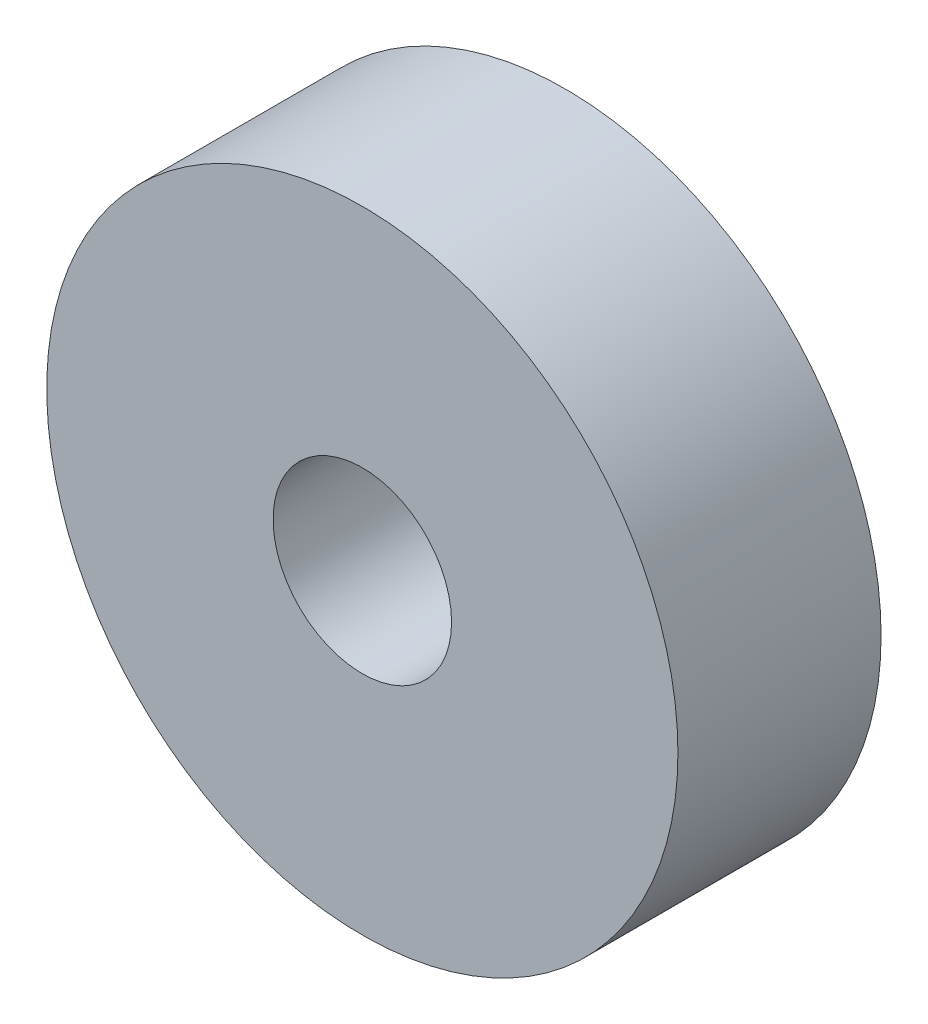
ISO-10303-21;
HEADER;
FILE_DESCRIPTION(('STEP AP214'),'2;1');
FILE_NAME('part.step','',(''),(''),'','','');
FILE_SCHEMA(('AUTOMOTIVE_DESIGN { 1 0 10303 214 1 1 1 1 }'));
ENDSEC;
DATA;
#1=APPLICATION_CONTEXT('core data for automotive mechanical design processes');
#2=APPLICATION_PROTOCOL_DEFINITION('international standard','automotive_design',2000,#1);
#3=PRODUCT_CONTEXT('',#1,'mechanical');
#4=PRODUCT('Part','Part','',(#3));
#5=PRODUCT_RELATED_PRODUCT_CATEGORY('part','',(#4));
#6=PRODUCT_DEFINITION_FORMATION('','',#4);
#7=PRODUCT_DEFINITION_CONTEXT('part definition',#1,'design');
#8=PRODUCT_DEFINITION('design','',#6,#7);
#9=PRODUCT_DEFINITION_SHAPE('','',#8);
#10=(LENGTH_UNIT() NAMED_UNIT(*) SI_UNIT(.MILLI.,.METRE.));
#11=(NAMED_UNIT(*) PLANE_ANGLE_UNIT() SI_UNIT($,.RADIAN.));
#12=(NAMED_UNIT(*) SI_UNIT($,.STERADIAN.) SOLID_ANGLE_UNIT());
#13=UNCERTAINTY_MEASURE_WITH_UNIT(LENGTH_MEASURE(1.E-05),#10,'distance_accuracy_value','');
#14=(GEOMETRIC_REPRESENTATION_CONTEXT(3) GLOBAL_UNCERTAINTY_ASSIGNED_CONTEXT((#13)) GLOBAL_UNIT_ASSIGNED_CONTEXT((#10,
#11,#12)) REPRESENTATION_CONTEXT('',''));
#15=CARTESIAN_POINT('',(0.,0.,0.));
#16=DIRECTION('',(0.,0.,1.));
#17=DIRECTION('',(1.,0.,0.));
#18=AXIS2_PLACEMENT_3D('',#15,#16,#17);
#19=CARTESIAN_POINT('',(0.,0.,7.));
#20=DIRECTION('',(0.,0.,1.));
#21=DIRECTION('',(1.,0.,0.));
#22=AXIS2_PLACEMENT_3D('',#19,#20,#21);
#23=PLANE('',#22);
#24=CARTESIAN_POINT('',(0.,0.,7.));
#25=DIRECTION('',(0.,0.,1.));
#26=DIRECTION('',(1.,0.,0.));
#27=AXIS2_PLACEMENT_3D('',#24,#25,#26);
#28=CIRCLE('',#27,10.875);
#29=CARTESIAN_POINT('',(10.875,0.,7.));
#30=VERTEX_POINT('',#29);
#31=EDGE_CURVE('E10',#30,#30,#28,.T.);
#32=ORIENTED_EDGE('',*,*,#31,.T.);
#33=EDGE_LOOP('',(#32));
#34=FACE_BOUND('',#33,.T.);
#35=CARTESIAN_POINT('',(0.,0.,7.));
#36=DIRECTION('',(0.,0.,1.));
#37=DIRECTION('',(1.,0.,0.));
#38=AXIS2_PLACEMENT_3D('',#35,#36,#37);
#39=CIRCLE('',#38,3.075);
#40=CARTESIAN_POINT('',(3.075,0.,7.));
#41=VERTEX_POINT('',#40);
#42=EDGE_CURVE('E42',#41,#41,#39,.T.);
#43=ORIENTED_EDGE('',*,*,#42,.F.);
#44=EDGE_LOOP('',(#43));
#45=FACE_BOUND('',#44,.T.);
#46=ADVANCED_FACE('F31',(#34,#45),#23,.T.);
#47=CARTESIAN_POINT('',(0.,0.,0.));
#48=DIRECTION('',(0.,0.,1.));
#49=DIRECTION('',(1.,0.,0.));
#50=AXIS2_PLACEMENT_3D('',#47,#48,#49);
#51=PLANE('',#50);
#52=CARTESIAN_POINT('',(0.,0.,0.));
#53=DIRECTION('',(0.,0.,1.));
#54=DIRECTION('',(1.,0.,0.));
#55=AXIS2_PLACEMENT_3D('',#52,#53,#54);
#56=CIRCLE('',#55,10.875);
#57=CARTESIAN_POINT('',(10.875,0.,0.));
#58=VERTEX_POINT('',#57);
#59=EDGE_CURVE('E35',#58,#58,#56,.T.);
#60=ORIENTED_EDGE('',*,*,#59,.F.);
#61=EDGE_LOOP('',(#60));
#62=FACE_BOUND('',#61,.T.);
#63=CARTESIAN_POINT('',(0.,0.,0.));
#64=DIRECTION('',(0.,0.,1.));
#65=DIRECTION('',(1.,0.,0.));
#66=AXIS2_PLACEMENT_3D('',#63,#64,#65);
#67=CIRCLE('',#66,3.075);
#68=CARTESIAN_POINT('',(3.075,0.,0.));
#69=VERTEX_POINT('',#68);
#70=EDGE_CURVE('E44',#69,#69,#67,.T.);
#71=ORIENTED_EDGE('',*,*,#70,.T.);
#72=EDGE_LOOP('',(#71));
#73=FACE_BOUND('',#72,.T.);
#74=ADVANCED_FACE('F54',(#62,#73),#51,.F.);
#75=CARTESIAN_POINT('',(0.,0.,7.));
#76=DIRECTION('',(0.,0.,-1.));
#77=DIRECTION('',(-1.,0.,0.));
#78=AXIS2_PLACEMENT_3D('',#75,#76,#77);
#79=CYLINDRICAL_SURFACE('',#78,10.875);
#80=ORIENTED_EDGE('',*,*,#31,.F.);
#81=EDGE_LOOP('',(#80));
#82=FACE_BOUND('',#81,.T.);
#83=ORIENTED_EDGE('',*,*,#59,.T.);
#84=EDGE_LOOP('',(#83));
#85=FACE_BOUND('',#84,.T.);
#86=ADVANCED_FACE('F33',(#82,#85),#79,.T.);
#87=CARTESIAN_POINT('',(0.,0.,7.));
#88=DIRECTION('',(0.,0.,-1.));
#89=DIRECTION('',(-1.,0.,0.));
#90=AXIS2_PLACEMENT_3D('',#87,#88,#89);
#91=CYLINDRICAL_SURFACE('',#90,3.075);
#92=ORIENTED_EDGE('',*,*,#42,.T.);
#93=EDGE_LOOP('',(#92));
#94=FACE_BOUND('',#93,.T.);
#95=ORIENTED_EDGE('',*,*,#70,.F.);
#96=EDGE_LOOP('',(#95));
#97=FACE_BOUND('',#96,.T.);
#98=ADVANCED_FACE('F50',(#94,#97),#91,.F.);
#99=CLOSED_SHELL('',(#46,#74,#86,#98));
#100=MANIFOLD_SOLID_BREP('B2',#99);
#101=ADVANCED_BREP_SHAPE_REPRESENTATION('',(#18,#100),#14);
#102=SHAPE_DEFINITION_REPRESENTATION(#9,#101);
ENDSEC;
END-ISO-10303-21;
